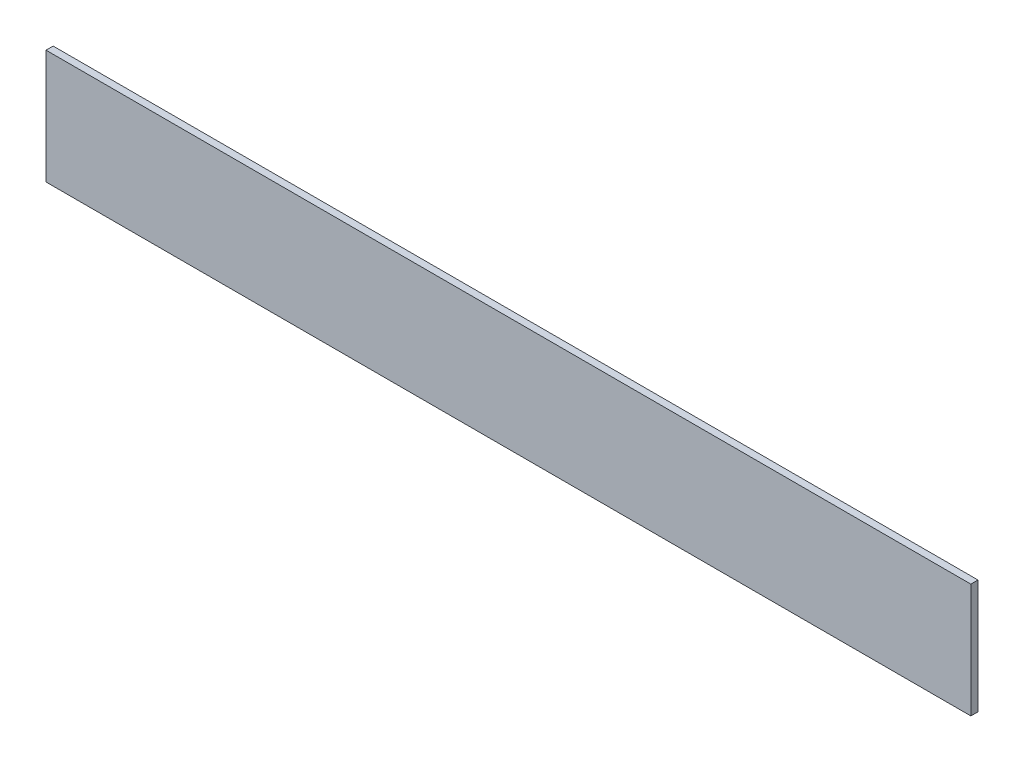
ISO-10303-21;
HEADER;
FILE_DESCRIPTION(('STEP AP214'),'2;1');
FILE_NAME('part.step','',(''),(''),'','','');
FILE_SCHEMA(('AUTOMOTIVE_DESIGN { 1 0 10303 214 1 1 1 1 }'));
ENDSEC;
DATA;
#1=APPLICATION_CONTEXT('core data for automotive mechanical design processes');
#2=APPLICATION_PROTOCOL_DEFINITION('international standard','automotive_design',2000,#1);
#3=PRODUCT_CONTEXT('',#1,'mechanical');
#4=PRODUCT('Part','Part','',(#3));
#5=PRODUCT_RELATED_PRODUCT_CATEGORY('part','',(#4));
#6=PRODUCT_DEFINITION_FORMATION('','',#4);
#7=PRODUCT_DEFINITION_CONTEXT('part definition',#1,'design');
#8=PRODUCT_DEFINITION('design','',#6,#7);
#9=PRODUCT_DEFINITION_SHAPE('','',#8);
#10=(LENGTH_UNIT() NAMED_UNIT(*) SI_UNIT(.MILLI.,.METRE.));
#11=(NAMED_UNIT(*) PLANE_ANGLE_UNIT() SI_UNIT($,.RADIAN.));
#12=(NAMED_UNIT(*) SI_UNIT($,.STERADIAN.) SOLID_ANGLE_UNIT());
#13=UNCERTAINTY_MEASURE_WITH_UNIT(LENGTH_MEASURE(1.E-05),#10,'distance_accuracy_value','');
#14=(GEOMETRIC_REPRESENTATION_CONTEXT(3) GLOBAL_UNCERTAINTY_ASSIGNED_CONTEXT((#13)) GLOBAL_UNIT_ASSIGNED_CONTEXT((#10,
#11,#12)) REPRESENTATION_CONTEXT('',''));
#15=CARTESIAN_POINT('',(0.,0.,0.));
#16=DIRECTION('',(0.,0.,1.));
#17=DIRECTION('',(1.,0.,0.));
#18=AXIS2_PLACEMENT_3D('',#15,#16,#17);
#19=CARTESIAN_POINT('',(0.,0.,6.35));
#20=DIRECTION('',(-1.,0.,0.));
#21=DIRECTION('',(0.,0.,1.));
#22=AXIS2_PLACEMENT_3D('',#19,#20,#21);
#23=PLANE('',#22);
#24=DIRECTION('',(0.,1.,0.));
#25=VECTOR('',#24,1.);
#26=CARTESIAN_POINT('',(0.,0.,0.));
#27=LINE('',#26,#25);
#28=CARTESIAN_POINT('',(0.,0.,0.));
#29=VERTEX_POINT('',#28);
#30=CARTESIAN_POINT('',(0.,101.6,0.));
#31=VERTEX_POINT('',#30);
#32=EDGE_CURVE('E97',#29,#31,#27,.T.);
#33=ORIENTED_EDGE('',*,*,#32,.F.);
#34=DIRECTION('',(0.,0.,-1.));
#35=VECTOR('',#34,1.);
#36=CARTESIAN_POINT('',(0.,0.,6.35));
#37=LINE('',#36,#35);
#38=CARTESIAN_POINT('',(0.,0.,6.35));
#39=VERTEX_POINT('',#38);
#40=EDGE_CURVE('E11',#39,#29,#37,.T.);
#41=ORIENTED_EDGE('',*,*,#40,.F.);
#42=DIRECTION('',(0.,1.,0.));
#43=VECTOR('',#42,1.);
#44=CARTESIAN_POINT('',(0.,0.,6.35));
#45=LINE('',#44,#43);
#46=CARTESIAN_POINT('',(0.,101.6,6.35));
#47=VERTEX_POINT('',#46);
#48=EDGE_CURVE('E92',#39,#47,#45,.T.);
#49=ORIENTED_EDGE('',*,*,#48,.T.);
#50=DIRECTION('',(0.,0.,-1.));
#51=VECTOR('',#50,1.);
#52=CARTESIAN_POINT('',(0.,101.6,6.35));
#53=LINE('',#52,#51);
#54=EDGE_CURVE('E35',#47,#31,#53,.T.);
#55=ORIENTED_EDGE('',*,*,#54,.T.);
#56=EDGE_LOOP('',(#33,#41,#49,#55));
#57=FACE_BOUND('',#56,.T.);
#58=ADVANCED_FACE('F32',(#57),#23,.T.);
#59=CARTESIAN_POINT('',(0.,0.,6.35));
#60=DIRECTION('',(0.,1.,0.));
#61=DIRECTION('',(0.,0.,1.));
#62=AXIS2_PLACEMENT_3D('',#59,#60,#61);
#63=PLANE('',#62);
#64=DIRECTION('',(1.,0.,0.));
#65=VECTOR('',#64,1.);
#66=CARTESIAN_POINT('',(0.,0.,0.));
#67=LINE('',#66,#65);
#68=CARTESIAN_POINT('',(822.959999999999,0.,0.));
#69=VERTEX_POINT('',#68);
#70=EDGE_CURVE('E65',#29,#69,#67,.T.);
#71=ORIENTED_EDGE('',*,*,#70,.T.);
#72=DIRECTION('',(0.,0.,-1.));
#73=VECTOR('',#72,1.);
#74=CARTESIAN_POINT('',(822.959999999999,0.,6.35));
#75=LINE('',#74,#73);
#76=CARTESIAN_POINT('',(822.959999999999,0.,6.35));
#77=VERTEX_POINT('',#76);
#78=EDGE_CURVE('E41',#77,#69,#75,.T.);
#79=ORIENTED_EDGE('',*,*,#78,.F.);
#80=DIRECTION('',(1.,0.,0.));
#81=VECTOR('',#80,1.);
#82=CARTESIAN_POINT('',(0.,0.,6.35));
#83=LINE('',#82,#81);
#84=EDGE_CURVE('E82',#39,#77,#83,.T.);
#85=ORIENTED_EDGE('',*,*,#84,.F.);
#86=ORIENTED_EDGE('',*,*,#40,.T.);
#87=EDGE_LOOP('',(#71,#79,#85,#86));
#88=FACE_BOUND('',#87,.T.);
#89=ADVANCED_FACE('F107',(#88),#63,.F.);
#90=CARTESIAN_POINT('',(822.959999999999,0.,6.35));
#91=DIRECTION('',(-1.,0.,0.));
#92=DIRECTION('',(0.,0.,1.));
#93=AXIS2_PLACEMENT_3D('',#90,#91,#92);
#94=PLANE('',#93);
#95=DIRECTION('',(0.,1.,0.));
#96=VECTOR('',#95,1.);
#97=CARTESIAN_POINT('',(822.959999999999,0.,0.));
#98=LINE('',#97,#96);
#99=CARTESIAN_POINT('',(822.959999999999,101.6,0.));
#100=VERTEX_POINT('',#99);
#101=EDGE_CURVE('E89',#69,#100,#98,.T.);
#102=ORIENTED_EDGE('',*,*,#101,.T.);
#103=DIRECTION('',(0.,0.,-1.));
#104=VECTOR('',#103,1.);
#105=CARTESIAN_POINT('',(822.959999999999,101.6,6.35));
#106=LINE('',#105,#104);
#107=CARTESIAN_POINT('',(822.959999999999,101.6,6.35));
#108=VERTEX_POINT('',#107);
#109=EDGE_CURVE('E86',#108,#100,#106,.T.);
#110=ORIENTED_EDGE('',*,*,#109,.F.);
#111=DIRECTION('',(0.,1.,0.));
#112=VECTOR('',#111,1.);
#113=CARTESIAN_POINT('',(822.959999999999,0.,6.35));
#114=LINE('',#113,#112);
#115=EDGE_CURVE('E77',#77,#108,#114,.T.);
#116=ORIENTED_EDGE('',*,*,#115,.F.);
#117=ORIENTED_EDGE('',*,*,#78,.T.);
#118=EDGE_LOOP('',(#102,#110,#116,#117));
#119=FACE_BOUND('',#118,.T.);
#120=ADVANCED_FACE('F87',(#119),#94,.F.);
#121=CARTESIAN_POINT('',(0.,101.6,6.35));
#122=DIRECTION('',(0.,1.,0.));
#123=DIRECTION('',(0.,0.,1.));
#124=AXIS2_PLACEMENT_3D('',#121,#122,#123);
#125=PLANE('',#124);
#126=DIRECTION('',(1.,0.,0.));
#127=VECTOR('',#126,1.);
#128=CARTESIAN_POINT('',(0.,101.6,0.));
#129=LINE('',#128,#127);
#130=EDGE_CURVE('E100',#31,#100,#129,.T.);
#131=ORIENTED_EDGE('',*,*,#130,.F.);
#132=ORIENTED_EDGE('',*,*,#54,.F.);
#133=DIRECTION('',(1.,0.,0.));
#134=VECTOR('',#133,1.);
#135=CARTESIAN_POINT('',(0.,101.6,6.35));
#136=LINE('',#135,#134);
#137=EDGE_CURVE('E81',#47,#108,#136,.T.);
#138=ORIENTED_EDGE('',*,*,#137,.T.);
#139=ORIENTED_EDGE('',*,*,#109,.T.);
#140=EDGE_LOOP('',(#131,#132,#138,#139));
#141=FACE_BOUND('',#140,.T.);
#142=ADVANCED_FACE('F91',(#141),#125,.T.);
#143=CARTESIAN_POINT('',(0.,0.,6.35));
#144=DIRECTION('',(0.,0.,-1.));
#145=DIRECTION('',(-1.,0.,0.));
#146=AXIS2_PLACEMENT_3D('',#143,#144,#145);
#147=PLANE('',#146);
#148=ORIENTED_EDGE('',*,*,#48,.F.);
#149=ORIENTED_EDGE('',*,*,#84,.T.);
#150=ORIENTED_EDGE('',*,*,#115,.T.);
#151=ORIENTED_EDGE('',*,*,#137,.F.);
#152=EDGE_LOOP('',(#148,#149,#150,#151));
#153=FACE_BOUND('',#152,.T.);
#154=ADVANCED_FACE('F80',(#153),#147,.F.);
#155=CARTESIAN_POINT('',(0.,0.,0.));
#156=DIRECTION('',(0.,0.,-1.));
#157=DIRECTION('',(-1.,0.,0.));
#158=AXIS2_PLACEMENT_3D('',#155,#156,#157);
#159=PLANE('',#158);
#160=ORIENTED_EDGE('',*,*,#32,.T.);
#161=ORIENTED_EDGE('',*,*,#130,.T.);
#162=ORIENTED_EDGE('',*,*,#101,.F.);
#163=ORIENTED_EDGE('',*,*,#70,.F.);
#164=EDGE_LOOP('',(#160,#161,#162,#163));
#165=FACE_BOUND('',#164,.T.);
#166=ADVANCED_FACE('F105',(#165),#159,.T.);
#167=CLOSED_SHELL('',(#58,#89,#120,#142,#154,#166));
#168=MANIFOLD_SOLID_BREP('B2',#167);
#169=ADVANCED_BREP_SHAPE_REPRESENTATION('',(#18,#168),#14);
#170=SHAPE_DEFINITION_REPRESENTATION(#9,#169);
ENDSEC;
END-ISO-10303-21;
